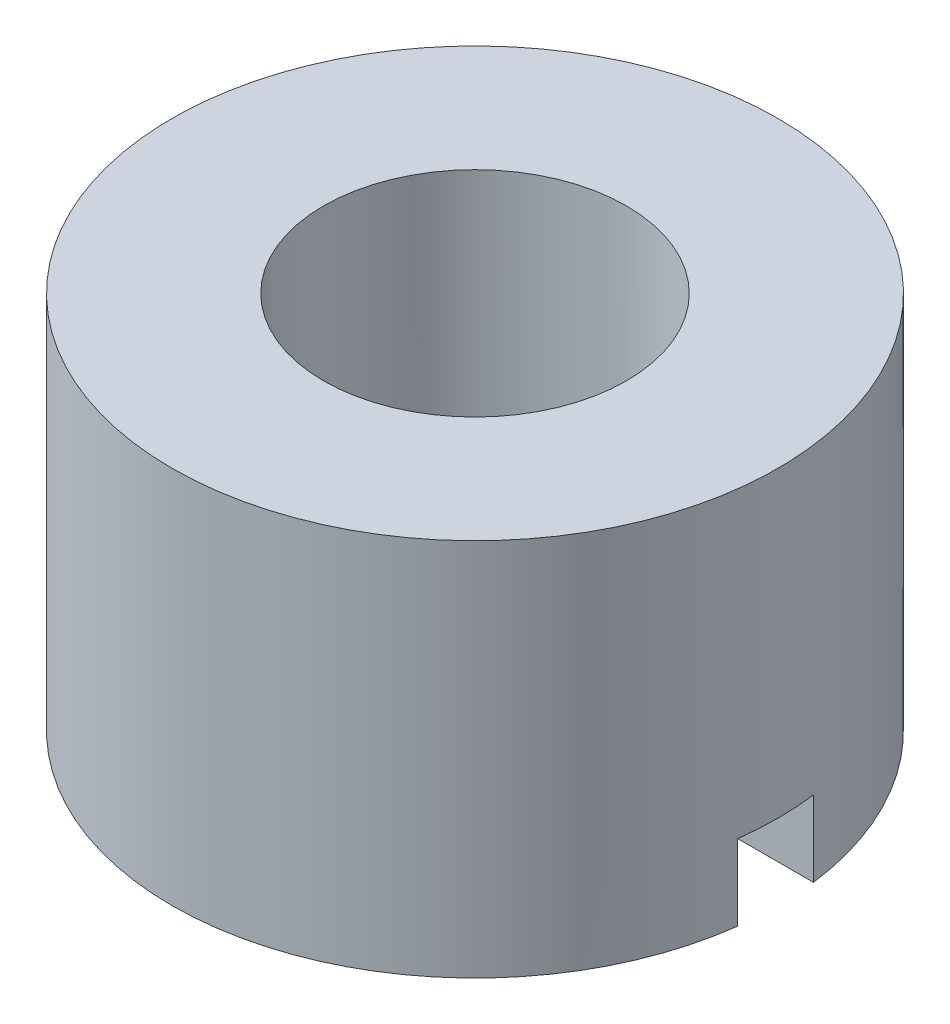
ISO-10303-21;
HEADER;
FILE_DESCRIPTION(('STEP AP214'),'2;1');
FILE_NAME('part.step','',(''),(''),'','','');
FILE_SCHEMA(('AUTOMOTIVE_DESIGN { 1 0 10303 214 1 1 1 1 }'));
ENDSEC;
DATA;
#1=APPLICATION_CONTEXT('core data for automotive mechanical design processes');
#2=APPLICATION_PROTOCOL_DEFINITION('international standard','automotive_design',2000,#1);
#3=PRODUCT_CONTEXT('',#1,'mechanical');
#4=PRODUCT('Part','Part','',(#3));
#5=PRODUCT_RELATED_PRODUCT_CATEGORY('part','',(#4));
#6=PRODUCT_DEFINITION_FORMATION('','',#4);
#7=PRODUCT_DEFINITION_CONTEXT('part definition',#1,'design');
#8=PRODUCT_DEFINITION('design','',#6,#7);
#9=PRODUCT_DEFINITION_SHAPE('','',#8);
#10=(LENGTH_UNIT() NAMED_UNIT(*) SI_UNIT(.MILLI.,.METRE.));
#11=(NAMED_UNIT(*) PLANE_ANGLE_UNIT() SI_UNIT($,.RADIAN.));
#12=(NAMED_UNIT(*) SI_UNIT($,.STERADIAN.) SOLID_ANGLE_UNIT());
#13=UNCERTAINTY_MEASURE_WITH_UNIT(LENGTH_MEASURE(1.E-05),#10,'distance_accuracy_value','');
#14=(GEOMETRIC_REPRESENTATION_CONTEXT(3) GLOBAL_UNCERTAINTY_ASSIGNED_CONTEXT((#13)) GLOBAL_UNIT_ASSIGNED_CONTEXT((#10,
#11,#12)) REPRESENTATION_CONTEXT('',''));
#15=CARTESIAN_POINT('',(0.,0.,0.));
#16=DIRECTION('',(0.,0.,1.));
#17=DIRECTION('',(1.,0.,0.));
#18=AXIS2_PLACEMENT_3D('',#15,#16,#17);
#19=CARTESIAN_POINT('',(0.,-5.17307692307692,-4.));
#20=DIRECTION('',(0.,1.,0.));
#21=DIRECTION('',(0.,0.,1.));
#22=AXIS2_PLACEMENT_3D('',#19,#20,#21);
#23=PLANE('',#22);
#24=CARTESIAN_POINT('',(0.,-5.17307692307692,0.));
#25=DIRECTION('',(0.,1.,0.));
#26=DIRECTION('',(0.,0.,1.));
#27=AXIS2_PLACEMENT_3D('',#24,#25,#26);
#28=CIRCLE('',#27,8.);
#29=CARTESIAN_POINT('',(7.93725393319377,-5.17307692307692,-1.));
#30=VERTEX_POINT('',#29);
#31=CARTESIAN_POINT('',(-7.93725393319377,-5.17307692307692,-1.));
#32=VERTEX_POINT('',#31);
#33=EDGE_CURVE('E166',#30,#32,#28,.T.);
#34=ORIENTED_EDGE('',*,*,#33,.F.);
#35=DIRECTION('',(1.,0.,0.));
#36=VECTOR('',#35,1.);
#37=CARTESIAN_POINT('',(-8.,-5.17307692307692,-1.));
#38=LINE('',#37,#36);
#39=CARTESIAN_POINT('',(3.87298334620742,-5.17307692307692,-1.));
#40=VERTEX_POINT('',#39);
#41=EDGE_CURVE('E199',#40,#30,#38,.T.);
#42=ORIENTED_EDGE('',*,*,#41,.F.);
#43=CARTESIAN_POINT('',(0.,-5.17307692307692,0.));
#44=DIRECTION('',(0.,1.,0.));
#45=DIRECTION('',(0.,0.,1.));
#46=AXIS2_PLACEMENT_3D('',#43,#44,#45);
#47=CIRCLE('',#46,4.);
#48=CARTESIAN_POINT('',(-3.87298334620742,-5.17307692307692,-1.));
#49=VERTEX_POINT('',#48);
#50=EDGE_CURVE('E169',#40,#49,#47,.T.);
#51=ORIENTED_EDGE('',*,*,#50,.T.);
#52=EDGE_CURVE('E193',#32,#49,#38,.T.);
#53=ORIENTED_EDGE('',*,*,#52,.F.);
#54=EDGE_LOOP('',(#34,#42,#51,#53));
#55=FACE_BOUND('',#54,.T.);
#56=ADVANCED_FACE('F52',(#55),#23,.F.);
#57=CARTESIAN_POINT('',(0.,4.82692307692308,-8.));
#58=DIRECTION('',(0.,-1.,0.));
#59=DIRECTION('',(0.,0.,-1.));
#60=AXIS2_PLACEMENT_3D('',#57,#58,#59);
#61=PLANE('',#60);
#62=CARTESIAN_POINT('',(0.,4.82692307692308,0.));
#63=DIRECTION('',(0.,1.,0.));
#64=DIRECTION('',(0.,0.,1.));
#65=AXIS2_PLACEMENT_3D('',#62,#63,#64);
#66=CIRCLE('',#65,4.);
#67=CARTESIAN_POINT('',(0.,4.82692307692308,4.));
#68=VERTEX_POINT('',#67);
#69=EDGE_CURVE('E170',#68,#68,#66,.T.);
#70=ORIENTED_EDGE('',*,*,#69,.F.);
#71=EDGE_LOOP('',(#70));
#72=FACE_BOUND('',#71,.T.);
#73=CARTESIAN_POINT('',(0.,4.82692307692308,0.));
#74=DIRECTION('',(0.,1.,0.));
#75=DIRECTION('',(0.,0.,1.));
#76=AXIS2_PLACEMENT_3D('',#73,#74,#75);
#77=CIRCLE('',#76,8.);
#78=CARTESIAN_POINT('',(0.,4.82692307692308,8.));
#79=VERTEX_POINT('',#78);
#80=EDGE_CURVE('E158',#79,#79,#77,.T.);
#81=ORIENTED_EDGE('',*,*,#80,.T.);
#82=EDGE_LOOP('',(#81));
#83=FACE_BOUND('',#82,.T.);
#84=ADVANCED_FACE('F54',(#72,#83),#61,.F.);
#85=CARTESIAN_POINT('',(0.,8.05769230769231,0.));
#86=DIRECTION('',(0.,1.,0.));
#87=DIRECTION('',(0.,0.,1.));
#88=AXIS2_PLACEMENT_3D('',#85,#86,#87);
#89=CYLINDRICAL_SURFACE('',#88,4.);
#90=CARTESIAN_POINT('',(0.,-3.17307692307692,0.));
#91=DIRECTION('',(0.,1.,0.));
#92=DIRECTION('',(0.,0.,1.));
#93=AXIS2_PLACEMENT_3D('',#90,#91,#92);
#94=CIRCLE('',#93,4.);
#95=CARTESIAN_POINT('',(-3.87298334620742,-3.17307692307692,1.));
#96=VERTEX_POINT('',#95);
#97=CARTESIAN_POINT('',(-3.87298334620742,-3.17307692307692,-1.));
#98=VERTEX_POINT('',#97);
#99=EDGE_CURVE('E117',#96,#98,#94,.F.);
#100=ORIENTED_EDGE('',*,*,#99,.T.);
#101=DIRECTION('',(0.,1.,0.));
#102=VECTOR('',#101,1.);
#103=CARTESIAN_POINT('',(-3.87298334620742,8.05769230769231,-0.999999999999997));
#104=LINE('',#103,#102);
#105=EDGE_CURVE('E155',#98,#49,#104,.F.);
#106=ORIENTED_EDGE('',*,*,#105,.T.);
#107=ORIENTED_EDGE('',*,*,#50,.F.);
#108=DIRECTION('',(0.,1.,0.));
#109=VECTOR('',#108,1.);
#110=CARTESIAN_POINT('',(3.87298334620742,8.05769230769231,-0.999999999999997));
#111=LINE('',#110,#109);
#112=CARTESIAN_POINT('',(3.87298334620742,-3.17307692307692,-1.));
#113=VERTEX_POINT('',#112);
#114=EDGE_CURVE('E148',#40,#113,#111,.T.);
#115=ORIENTED_EDGE('',*,*,#114,.T.);
#116=CARTESIAN_POINT('',(3.87298334620742,-3.17307692307692,1.));
#117=VERTEX_POINT('',#116);
#118=EDGE_CURVE('E126',#113,#117,#94,.F.);
#119=ORIENTED_EDGE('',*,*,#118,.T.);
#120=DIRECTION('',(0.,1.,0.));
#121=VECTOR('',#120,1.);
#122=CARTESIAN_POINT('',(3.87298334620742,8.05769230769231,1.));
#123=LINE('',#122,#121);
#124=CARTESIAN_POINT('',(3.87298334620742,-5.17307692307692,1.));
#125=VERTEX_POINT('',#124);
#126=EDGE_CURVE('E145',#117,#125,#123,.F.);
#127=ORIENTED_EDGE('',*,*,#126,.T.);
#128=CARTESIAN_POINT('',(-3.87298334620742,-5.17307692307692,1.));
#129=VERTEX_POINT('',#128);
#130=EDGE_CURVE('E143',#129,#125,#47,.T.);
#131=ORIENTED_EDGE('',*,*,#130,.F.);
#132=DIRECTION('',(0.,1.,0.));
#133=VECTOR('',#132,1.);
#134=CARTESIAN_POINT('',(-3.87298334620742,8.05769230769231,1.));
#135=LINE('',#134,#133);
#136=EDGE_CURVE('E125',#129,#96,#135,.T.);
#137=ORIENTED_EDGE('',*,*,#136,.T.);
#138=EDGE_LOOP('',(#100,#106,#107,#115,#119,#127,#131,#137));
#139=FACE_BOUND('',#138,.T.);
#140=ORIENTED_EDGE('',*,*,#69,.T.);
#141=EDGE_LOOP('',(#140));
#142=FACE_BOUND('',#141,.T.);
#143=ADVANCED_FACE('F139',(#139,#142),#89,.F.);
#144=CARTESIAN_POINT('',(-7.93725393319377,-5.17307692307692,1.));
#145=VERTEX_POINT('',#144);
#146=CARTESIAN_POINT('',(7.93725393319377,-5.17307692307692,1.));
#147=VERTEX_POINT('',#146);
#148=EDGE_CURVE('E162',#145,#147,#28,.T.);
#149=ORIENTED_EDGE('',*,*,#148,.F.);
#150=DIRECTION('',(1.,0.,0.));
#151=VECTOR('',#150,1.);
#152=CARTESIAN_POINT('',(-8.,-5.17307692307692,1.));
#153=LINE('',#152,#151);
#154=EDGE_CURVE('E204',#145,#129,#153,.T.);
#155=ORIENTED_EDGE('',*,*,#154,.T.);
#156=ORIENTED_EDGE('',*,*,#130,.T.);
#157=EDGE_CURVE('E135',#125,#147,#153,.T.);
#158=ORIENTED_EDGE('',*,*,#157,.T.);
#159=EDGE_LOOP('',(#149,#155,#156,#158));
#160=FACE_BOUND('',#159,.T.);
#161=ADVANCED_FACE('F215',(#160),#23,.F.);
#162=CARTESIAN_POINT('',(0.,8.05769230769231,0.));
#163=DIRECTION('',(0.,1.,0.));
#164=DIRECTION('',(0.,0.,1.));
#165=AXIS2_PLACEMENT_3D('',#162,#163,#164);
#166=CYLINDRICAL_SURFACE('',#165,8.);
#167=ORIENTED_EDGE('',*,*,#80,.F.);
#168=EDGE_LOOP('',(#167));
#169=FACE_BOUND('',#168,.T.);
#170=ORIENTED_EDGE('',*,*,#148,.T.);
#171=DIRECTION('',(0.,1.,0.));
#172=VECTOR('',#171,1.);
#173=CARTESIAN_POINT('',(7.93725393319377,8.05769230769231,1.));
#174=LINE('',#173,#172);
#175=CARTESIAN_POINT('',(7.93725393319377,-3.17307692307692,1.));
#176=VERTEX_POINT('',#175);
#177=EDGE_CURVE('E12',#147,#176,#174,.T.);
#178=ORIENTED_EDGE('',*,*,#177,.T.);
#179=CARTESIAN_POINT('',(0.,-3.17307692307692,0.));
#180=DIRECTION('',(0.,1.,0.));
#181=DIRECTION('',(0.,0.,1.));
#182=AXIS2_PLACEMENT_3D('',#179,#180,#181);
#183=CIRCLE('',#182,8.);
#184=CARTESIAN_POINT('',(7.93725393319377,-3.17307692307692,-1.));
#185=VERTEX_POINT('',#184);
#186=EDGE_CURVE('E174',#176,#185,#183,.T.);
#187=ORIENTED_EDGE('',*,*,#186,.T.);
#188=DIRECTION('',(0.,1.,0.));
#189=VECTOR('',#188,1.);
#190=CARTESIAN_POINT('',(7.93725393319377,8.05769230769231,-0.999999999999997));
#191=LINE('',#190,#189);
#192=EDGE_CURVE('E178',#185,#30,#191,.F.);
#193=ORIENTED_EDGE('',*,*,#192,.T.);
#194=ORIENTED_EDGE('',*,*,#33,.T.);
#195=DIRECTION('',(0.,1.,0.));
#196=VECTOR('',#195,1.);
#197=CARTESIAN_POINT('',(-7.93725393319377,8.05769230769231,-0.999999999999997));
#198=LINE('',#197,#196);
#199=CARTESIAN_POINT('',(-7.93725393319377,-3.17307692307692,-1.));
#200=VERTEX_POINT('',#199);
#201=EDGE_CURVE('E61',#32,#200,#198,.T.);
#202=ORIENTED_EDGE('',*,*,#201,.T.);
#203=CARTESIAN_POINT('',(-7.93725393319377,-3.17307692307692,1.));
#204=VERTEX_POINT('',#203);
#205=EDGE_CURVE('E179',#200,#204,#183,.T.);
#206=ORIENTED_EDGE('',*,*,#205,.T.);
#207=DIRECTION('',(0.,1.,0.));
#208=VECTOR('',#207,1.);
#209=CARTESIAN_POINT('',(-7.93725393319377,8.05769230769231,1.));
#210=LINE('',#209,#208);
#211=EDGE_CURVE('E132',#204,#145,#210,.F.);
#212=ORIENTED_EDGE('',*,*,#211,.T.);
#213=EDGE_LOOP('',(#170,#178,#187,#193,#194,#202,#206,#212));
#214=FACE_BOUND('',#213,.T.);
#215=ADVANCED_FACE('F188',(#169,#214),#166,.T.);
#216=CARTESIAN_POINT('',(-8.,-3.17307692307692,1.));
#217=DIRECTION('',(0.,1.,0.));
#218=DIRECTION('',(0.,0.,1.));
#219=AXIS2_PLACEMENT_3D('',#216,#217,#218);
#220=PLANE('',#219);
#221=DIRECTION('',(1.,0.,0.));
#222=VECTOR('',#221,1.);
#223=CARTESIAN_POINT('',(-8.,-3.17307692307692,1.));
#224=LINE('',#223,#222);
#225=EDGE_CURVE('E68',#204,#96,#224,.T.);
#226=ORIENTED_EDGE('',*,*,#225,.F.);
#227=ORIENTED_EDGE('',*,*,#205,.F.);
#228=DIRECTION('',(1.,0.,0.));
#229=VECTOR('',#228,1.);
#230=CARTESIAN_POINT('',(-8.,-3.17307692307692,-1.));
#231=LINE('',#230,#229);
#232=EDGE_CURVE('E120',#200,#98,#231,.T.);
#233=ORIENTED_EDGE('',*,*,#232,.T.);
#234=ORIENTED_EDGE('',*,*,#99,.F.);
#235=EDGE_LOOP('',(#226,#227,#233,#234));
#236=FACE_BOUND('',#235,.T.);
#237=ADVANCED_FACE('F118',(#236),#220,.F.);
#238=CARTESIAN_POINT('',(-8.,-3.17307692307692,1.));
#239=DIRECTION('',(0.,0.,1.));
#240=DIRECTION('',(0.,-1.,0.));
#241=AXIS2_PLACEMENT_3D('',#238,#239,#240);
#242=PLANE('',#241);
#243=ORIENTED_EDGE('',*,*,#154,.F.);
#244=ORIENTED_EDGE('',*,*,#211,.F.);
#245=ORIENTED_EDGE('',*,*,#225,.T.);
#246=ORIENTED_EDGE('',*,*,#136,.F.);
#247=EDGE_LOOP('',(#243,#244,#245,#246));
#248=FACE_BOUND('',#247,.T.);
#249=ADVANCED_FACE('F129',(#248),#242,.F.);
#250=CARTESIAN_POINT('',(-8.,-3.17307692307692,-1.));
#251=DIRECTION('',(0.,0.,-1.));
#252=DIRECTION('',(0.,1.,0.));
#253=AXIS2_PLACEMENT_3D('',#250,#251,#252);
#254=PLANE('',#253);
#255=ORIENTED_EDGE('',*,*,#232,.F.);
#256=ORIENTED_EDGE('',*,*,#201,.F.);
#257=ORIENTED_EDGE('',*,*,#52,.T.);
#258=ORIENTED_EDGE('',*,*,#105,.F.);
#259=EDGE_LOOP('',(#255,#256,#257,#258));
#260=FACE_BOUND('',#259,.T.);
#261=ADVANCED_FACE('F192',(#260),#254,.F.);
#262=ORIENTED_EDGE('',*,*,#41,.T.);
#263=ORIENTED_EDGE('',*,*,#192,.F.);
#264=EDGE_CURVE('E76',#113,#185,#231,.T.);
#265=ORIENTED_EDGE('',*,*,#264,.F.);
#266=ORIENTED_EDGE('',*,*,#114,.F.);
#267=EDGE_LOOP('',(#262,#263,#265,#266));
#268=FACE_BOUND('',#267,.T.);
#269=ADVANCED_FACE('F221',(#268),#254,.F.);
#270=EDGE_CURVE('E136',#117,#176,#224,.T.);
#271=ORIENTED_EDGE('',*,*,#270,.T.);
#272=ORIENTED_EDGE('',*,*,#177,.F.);
#273=ORIENTED_EDGE('',*,*,#157,.F.);
#274=ORIENTED_EDGE('',*,*,#126,.F.);
#275=EDGE_LOOP('',(#271,#272,#273,#274));
#276=FACE_BOUND('',#275,.T.);
#277=ADVANCED_FACE('F217',(#276),#242,.F.);
#278=ORIENTED_EDGE('',*,*,#264,.T.);
#279=ORIENTED_EDGE('',*,*,#186,.F.);
#280=ORIENTED_EDGE('',*,*,#270,.F.);
#281=ORIENTED_EDGE('',*,*,#118,.F.);
#282=EDGE_LOOP('',(#278,#279,#280,#281));
#283=FACE_BOUND('',#282,.T.);
#284=ADVANCED_FACE('F219',(#283),#220,.F.);
#285=CLOSED_SHELL('',(#56,#84,#143,#161,#215,#237,#249,#261,#269,#277,#284));
#286=MANIFOLD_SOLID_BREP('B2',#285);
#287=ADVANCED_BREP_SHAPE_REPRESENTATION('',(#18,#286),#14);
#288=SHAPE_DEFINITION_REPRESENTATION(#9,#287);
ENDSEC;
END-ISO-10303-21;
